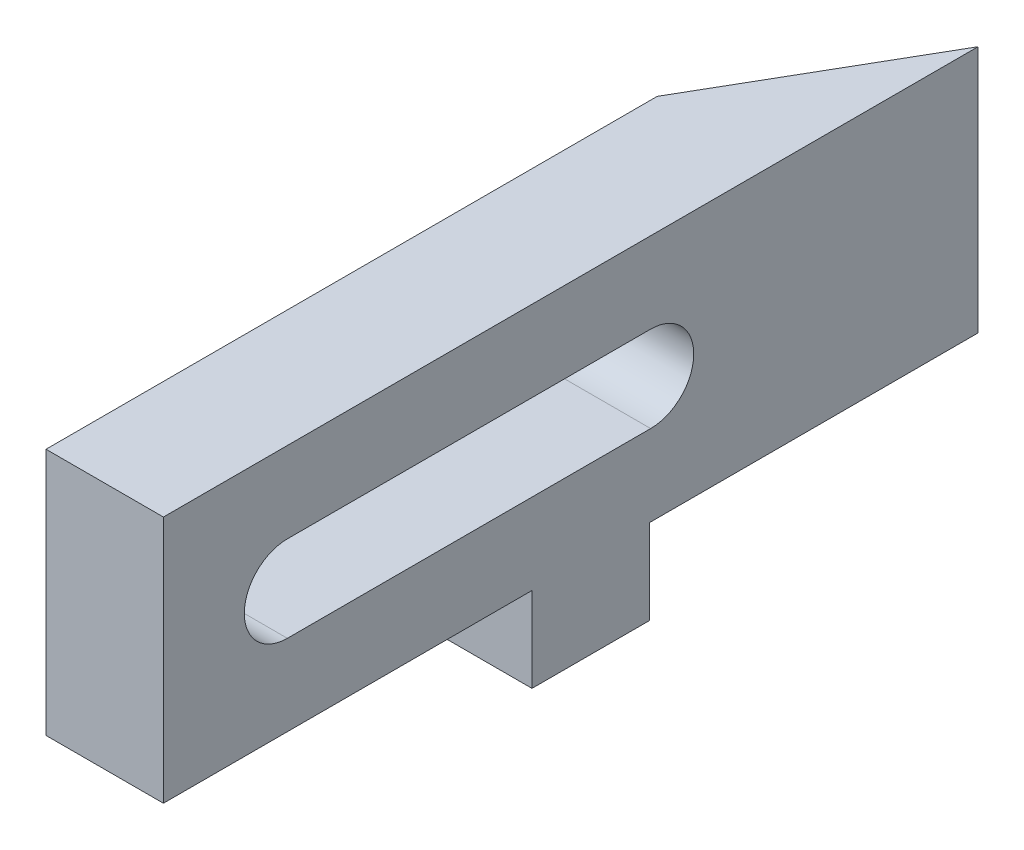
ISO-10303-21;
HEADER;
FILE_DESCRIPTION(('STEP AP214'),'2;1');
FILE_NAME('part.step','',(''),(''),'','','');
FILE_SCHEMA(('AUTOMOTIVE_DESIGN { 1 0 10303 214 1 1 1 1 }'));
ENDSEC;
DATA;
#1=APPLICATION_CONTEXT('core data for automotive mechanical design processes');
#2=APPLICATION_PROTOCOL_DEFINITION('international standard','automotive_design',2000,#1);
#3=PRODUCT_CONTEXT('',#1,'mechanical');
#4=PRODUCT('Part','Part','',(#3));
#5=PRODUCT_RELATED_PRODUCT_CATEGORY('part','',(#4));
#6=PRODUCT_DEFINITION_FORMATION('','',#4);
#7=PRODUCT_DEFINITION_CONTEXT('part definition',#1,'design');
#8=PRODUCT_DEFINITION('design','',#6,#7);
#9=PRODUCT_DEFINITION_SHAPE('','',#8);
#10=(LENGTH_UNIT() NAMED_UNIT(*) SI_UNIT(.MILLI.,.METRE.));
#11=(NAMED_UNIT(*) PLANE_ANGLE_UNIT() SI_UNIT($,.RADIAN.));
#12=(NAMED_UNIT(*) SI_UNIT($,.STERADIAN.) SOLID_ANGLE_UNIT());
#13=UNCERTAINTY_MEASURE_WITH_UNIT(LENGTH_MEASURE(1.E-05),#10,'distance_accuracy_value','');
#14=(GEOMETRIC_REPRESENTATION_CONTEXT(3) GLOBAL_UNCERTAINTY_ASSIGNED_CONTEXT((#13)) GLOBAL_UNIT_ASSIGNED_CONTEXT((#10,
#11,#12)) REPRESENTATION_CONTEXT('',''));
#15=CARTESIAN_POINT('',(0.,0.,0.));
#16=DIRECTION('',(0.,0.,1.));
#17=DIRECTION('',(1.,0.,0.));
#18=AXIS2_PLACEMENT_3D('',#15,#16,#17);
#19=CARTESIAN_POINT('',(0.,0.,0.));
#20=DIRECTION('',(0.,1.,0.));
#21=DIRECTION('',(0.,0.,1.));
#22=AXIS2_PLACEMENT_3D('',#19,#20,#21);
#23=PLANE('',#22);
#24=DIRECTION('',(-1.,0.,0.));
#25=VECTOR('',#24,1.);
#26=CARTESIAN_POINT('',(15.5,0.,-8.25));
#27=LINE('',#26,#25);
#28=CARTESIAN_POINT('',(24.5,0.,-8.25));
#29=VERTEX_POINT('',#28);
#30=CARTESIAN_POINT('',(15.5,0.,-8.25));
#31=VERTEX_POINT('',#30);
#32=EDGE_CURVE('E143',#29,#31,#27,.T.);
#33=ORIENTED_EDGE('',*,*,#32,.F.);
#34=DIRECTION('',(0.,0.,-1.));
#35=VECTOR('',#34,1.);
#36=CARTESIAN_POINT('',(24.5,0.,20.));
#37=LINE('',#36,#35);
#38=CARTESIAN_POINT('',(24.5,0.,20.));
#39=VERTEX_POINT('',#38);
#40=EDGE_CURVE('E201',#39,#29,#37,.T.);
#41=ORIENTED_EDGE('',*,*,#40,.F.);
#42=DIRECTION('',(1.,0.,0.));
#43=VECTOR('',#42,1.);
#44=CARTESIAN_POINT('',(15.5,0.,20.));
#45=LINE('',#44,#43);
#46=CARTESIAN_POINT('',(15.5,0.,20.));
#47=VERTEX_POINT('',#46);
#48=EDGE_CURVE('E212',#47,#39,#45,.T.);
#49=ORIENTED_EDGE('',*,*,#48,.F.);
#50=DIRECTION('',(0.,0.,1.));
#51=VECTOR('',#50,1.);
#52=CARTESIAN_POINT('',(15.5,0.,-26.8467875173176));
#53=LINE('',#52,#51);
#54=EDGE_CURVE('E50',#31,#47,#53,.T.);
#55=ORIENTED_EDGE('',*,*,#54,.F.);
#56=EDGE_LOOP('',(#33,#41,#49,#55));
#57=FACE_BOUND('',#56,.T.);
#58=ADVANCED_FACE('F33',(#57),#23,.F.);
#59=DIRECTION('',(1.,0.,0.));
#60=VECTOR('',#59,1.);
#61=CARTESIAN_POINT('',(24.5,0.,-17.25));
#62=LINE('',#61,#60);
#63=CARTESIAN_POINT('',(15.5,0.,-17.25));
#64=VERTEX_POINT('',#63);
#65=CARTESIAN_POINT('',(24.5,0.,-17.25));
#66=VERTEX_POINT('',#65);
#67=EDGE_CURVE('E58',#64,#66,#62,.T.);
#68=ORIENTED_EDGE('',*,*,#67,.F.);
#69=CARTESIAN_POINT('',(15.5,0.,-26.8467875173176));
#70=VERTEX_POINT('',#69);
#71=EDGE_CURVE('E146',#70,#64,#53,.T.);
#72=ORIENTED_EDGE('',*,*,#71,.F.);
#73=DIRECTION('',(-0.5,0.,0.866025403784439));
#74=VECTOR('',#73,1.);
#75=CARTESIAN_POINT('',(24.5,0.,-42.4352447854375));
#76=LINE('',#75,#74);
#77=CARTESIAN_POINT('',(24.5,0.,-42.4352447854375));
#78=VERTEX_POINT('',#77);
#79=EDGE_CURVE('E190',#78,#70,#76,.T.);
#80=ORIENTED_EDGE('',*,*,#79,.F.);
#81=EDGE_CURVE('E219',#66,#78,#37,.T.);
#82=ORIENTED_EDGE('',*,*,#81,.F.);
#83=EDGE_LOOP('',(#68,#72,#80,#82));
#84=FACE_BOUND('',#83,.T.);
#85=ADVANCED_FACE('F251',(#84),#23,.F.);
#86=CARTESIAN_POINT('',(24.5,19.,-42.4352447854375));
#87=DIRECTION('',(0.866025403784439,0.,0.5));
#88=DIRECTION('',(0.5,0.,-0.866025403784439));
#89=AXIS2_PLACEMENT_3D('',#86,#87,#88);
#90=PLANE('',#89);
#91=ORIENTED_EDGE('',*,*,#79,.T.);
#92=DIRECTION('',(0.,-1.,0.));
#93=VECTOR('',#92,1.);
#94=CARTESIAN_POINT('',(15.5,19.,-26.8467875173176));
#95=LINE('',#94,#93);
#96=CARTESIAN_POINT('',(15.5,19.,-26.8467875173176));
#97=VERTEX_POINT('',#96);
#98=EDGE_CURVE('E11',#97,#70,#95,.T.);
#99=ORIENTED_EDGE('',*,*,#98,.F.);
#100=DIRECTION('',(-0.5,0.,0.866025403784439));
#101=VECTOR('',#100,1.);
#102=CARTESIAN_POINT('',(24.5,19.,-42.4352447854375));
#103=LINE('',#102,#101);
#104=CARTESIAN_POINT('',(24.5,19.,-42.4352447854375));
#105=VERTEX_POINT('',#104);
#106=EDGE_CURVE('E197',#105,#97,#103,.T.);
#107=ORIENTED_EDGE('',*,*,#106,.F.);
#108=DIRECTION('',(0.,-1.,0.));
#109=VECTOR('',#108,1.);
#110=CARTESIAN_POINT('',(24.5,19.,-42.4352447854375));
#111=LINE('',#110,#109);
#112=EDGE_CURVE('E207',#105,#78,#111,.T.);
#113=ORIENTED_EDGE('',*,*,#112,.T.);
#114=EDGE_LOOP('',(#91,#99,#107,#113));
#115=FACE_BOUND('',#114,.T.);
#116=ADVANCED_FACE('F35',(#115),#90,.F.);
#117=CARTESIAN_POINT('',(15.5,19.,-26.8467875173176));
#118=DIRECTION('',(1.,0.,0.));
#119=DIRECTION('',(0.,0.,-1.));
#120=AXIS2_PLACEMENT_3D('',#117,#118,#119);
#121=PLANE('',#120);
#122=DIRECTION('',(0.,0.,1.));
#123=VECTOR('',#122,1.);
#124=CARTESIAN_POINT('',(15.5,6.2,-17.3467875173176));
#125=LINE('',#124,#123);
#126=CARTESIAN_POINT('',(15.5,6.2,-17.3467875173176));
#127=VERTEX_POINT('',#126);
#128=CARTESIAN_POINT('',(15.5,6.2,10.5));
#129=VERTEX_POINT('',#128);
#130=EDGE_CURVE('E149',#127,#129,#125,.T.);
#131=ORIENTED_EDGE('',*,*,#130,.F.);
#132=CARTESIAN_POINT('',(15.5,9.5,-17.3467875173176));
#133=DIRECTION('',(-1.,0.,0.));
#134=DIRECTION('',(0.,0.,1.));
#135=AXIS2_PLACEMENT_3D('',#132,#133,#134);
#136=CIRCLE('',#135,3.3);
#137=CARTESIAN_POINT('',(15.5,12.8,-17.3467875173176));
#138=VERTEX_POINT('',#137);
#139=EDGE_CURVE('E147',#138,#127,#136,.T.);
#140=ORIENTED_EDGE('',*,*,#139,.F.);
#141=DIRECTION('',(0.,0.,-1.));
#142=VECTOR('',#141,1.);
#143=CARTESIAN_POINT('',(15.5,12.8,-17.3467875173176));
#144=LINE('',#143,#142);
#145=CARTESIAN_POINT('',(15.5,12.8,10.5));
#146=VERTEX_POINT('',#145);
#147=EDGE_CURVE('E171',#146,#138,#144,.T.);
#148=ORIENTED_EDGE('',*,*,#147,.F.);
#149=CARTESIAN_POINT('',(15.5,9.5,10.5));
#150=DIRECTION('',(-1.,0.,0.));
#151=DIRECTION('',(0.,0.,1.));
#152=AXIS2_PLACEMENT_3D('',#149,#150,#151);
#153=CIRCLE('',#152,3.3);
#154=EDGE_CURVE('E183',#129,#146,#153,.T.);
#155=ORIENTED_EDGE('',*,*,#154,.F.);
#156=EDGE_LOOP('',(#131,#140,#148,#155));
#157=FACE_BOUND('',#156,.T.);
#158=ORIENTED_EDGE('',*,*,#71,.T.);
#159=DIRECTION('',(0.,1.,0.));
#160=VECTOR('',#159,1.);
#161=CARTESIAN_POINT('',(15.5,-6.5,-17.25));
#162=LINE('',#161,#160);
#163=CARTESIAN_POINT('',(15.5,-6.5,-17.25));
#164=VERTEX_POINT('',#163);
#165=EDGE_CURVE('E128',#164,#64,#162,.T.);
#166=ORIENTED_EDGE('',*,*,#165,.F.);
#167=DIRECTION('',(0.,0.,-1.));
#168=VECTOR('',#167,1.);
#169=CARTESIAN_POINT('',(15.5,-6.5,-17.25));
#170=LINE('',#169,#168);
#171=CARTESIAN_POINT('',(15.5,-6.5,-8.25));
#172=VERTEX_POINT('',#171);
#173=EDGE_CURVE('E134',#172,#164,#170,.T.);
#174=ORIENTED_EDGE('',*,*,#173,.F.);
#175=DIRECTION('',(0.,1.,0.));
#176=VECTOR('',#175,1.);
#177=CARTESIAN_POINT('',(15.5,-6.5,-8.25));
#178=LINE('',#177,#176);
#179=EDGE_CURVE('E160',#172,#31,#178,.T.);
#180=ORIENTED_EDGE('',*,*,#179,.T.);
#181=ORIENTED_EDGE('',*,*,#54,.T.);
#182=DIRECTION('',(0.,-1.,0.));
#183=VECTOR('',#182,1.);
#184=CARTESIAN_POINT('',(15.5,19.,20.));
#185=LINE('',#184,#183);
#186=CARTESIAN_POINT('',(15.5,19.,20.));
#187=VERTEX_POINT('',#186);
#188=EDGE_CURVE('E42',#187,#47,#185,.T.);
#189=ORIENTED_EDGE('',*,*,#188,.F.);
#190=DIRECTION('',(0.,0.,1.));
#191=VECTOR('',#190,1.);
#192=CARTESIAN_POINT('',(15.5,19.,-26.8467875173176));
#193=LINE('',#192,#191);
#194=EDGE_CURVE('E200',#97,#187,#193,.T.);
#195=ORIENTED_EDGE('',*,*,#194,.F.);
#196=ORIENTED_EDGE('',*,*,#98,.T.);
#197=EDGE_LOOP('',(#158,#166,#174,#180,#181,#189,#195,#196));
#198=FACE_BOUND('',#197,.T.);
#199=ADVANCED_FACE('F145',(#157,#198),#121,.F.);
#200=CARTESIAN_POINT('',(15.5,19.,20.));
#201=DIRECTION('',(0.,0.,-1.));
#202=DIRECTION('',(-1.,0.,0.));
#203=AXIS2_PLACEMENT_3D('',#200,#201,#202);
#204=PLANE('',#203);
#205=ORIENTED_EDGE('',*,*,#48,.T.);
#206=DIRECTION('',(0.,-1.,0.));
#207=VECTOR('',#206,1.);
#208=CARTESIAN_POINT('',(24.5,19.,20.));
#209=LINE('',#208,#207);
#210=CARTESIAN_POINT('',(24.5,19.,20.));
#211=VERTEX_POINT('',#210);
#212=EDGE_CURVE('E226',#211,#39,#209,.T.);
#213=ORIENTED_EDGE('',*,*,#212,.F.);
#214=DIRECTION('',(1.,0.,0.));
#215=VECTOR('',#214,1.);
#216=CARTESIAN_POINT('',(15.5,19.,20.));
#217=LINE('',#216,#215);
#218=EDGE_CURVE('E203',#187,#211,#217,.T.);
#219=ORIENTED_EDGE('',*,*,#218,.F.);
#220=ORIENTED_EDGE('',*,*,#188,.T.);
#221=EDGE_LOOP('',(#205,#213,#219,#220));
#222=FACE_BOUND('',#221,.T.);
#223=ADVANCED_FACE('F233',(#222),#204,.F.);
#224=CARTESIAN_POINT('',(24.5,19.,20.));
#225=DIRECTION('',(-1.,0.,0.));
#226=DIRECTION('',(0.,0.,1.));
#227=AXIS2_PLACEMENT_3D('',#224,#225,#226);
#228=PLANE('',#227);
#229=DIRECTION('',(0.,0.,-1.));
#230=VECTOR('',#229,1.);
#231=CARTESIAN_POINT('',(24.5,12.8,-17.3467875173176));
#232=LINE('',#231,#230);
#233=CARTESIAN_POINT('',(24.5,12.8,10.5));
#234=VERTEX_POINT('',#233);
#235=CARTESIAN_POINT('',(24.5,12.8,-17.3467875173176));
#236=VERTEX_POINT('',#235);
#237=EDGE_CURVE('E177',#234,#236,#232,.T.);
#238=ORIENTED_EDGE('',*,*,#237,.T.);
#239=CARTESIAN_POINT('',(24.5,9.5,-17.3467875173176));
#240=DIRECTION('',(-1.,0.,0.));
#241=DIRECTION('',(0.,0.,1.));
#242=AXIS2_PLACEMENT_3D('',#239,#240,#241);
#243=CIRCLE('',#242,3.3);
#244=CARTESIAN_POINT('',(24.5,6.2,-17.3467875173176));
#245=VERTEX_POINT('',#244);
#246=EDGE_CURVE('E167',#236,#245,#243,.T.);
#247=ORIENTED_EDGE('',*,*,#246,.T.);
#248=DIRECTION('',(0.,0.,1.));
#249=VECTOR('',#248,1.);
#250=CARTESIAN_POINT('',(24.5,6.2,-17.3467875173176));
#251=LINE('',#250,#249);
#252=CARTESIAN_POINT('',(24.5,6.2,10.5));
#253=VERTEX_POINT('',#252);
#254=EDGE_CURVE('E170',#245,#253,#251,.T.);
#255=ORIENTED_EDGE('',*,*,#254,.T.);
#256=CARTESIAN_POINT('',(24.5,9.5,10.5));
#257=DIRECTION('',(-1.,0.,0.));
#258=DIRECTION('',(0.,0.,1.));
#259=AXIS2_PLACEMENT_3D('',#256,#257,#258);
#260=CIRCLE('',#259,3.3);
#261=EDGE_CURVE('E174',#253,#234,#260,.T.);
#262=ORIENTED_EDGE('',*,*,#261,.T.);
#263=EDGE_LOOP('',(#238,#247,#255,#262));
#264=FACE_BOUND('',#263,.T.);
#265=ORIENTED_EDGE('',*,*,#40,.T.);
#266=DIRECTION('',(0.,1.,0.));
#267=VECTOR('',#266,1.);
#268=CARTESIAN_POINT('',(24.5,-6.5,-8.25));
#269=LINE('',#268,#267);
#270=CARTESIAN_POINT('',(24.5,-6.5,-8.25));
#271=VERTEX_POINT('',#270);
#272=EDGE_CURVE('E151',#271,#29,#269,.T.);
#273=ORIENTED_EDGE('',*,*,#272,.F.);
#274=DIRECTION('',(0.,0.,1.));
#275=VECTOR('',#274,1.);
#276=CARTESIAN_POINT('',(24.5,-6.5,-8.25));
#277=LINE('',#276,#275);
#278=CARTESIAN_POINT('',(24.5,-6.5,-17.25));
#279=VERTEX_POINT('',#278);
#280=EDGE_CURVE('E133',#279,#271,#277,.T.);
#281=ORIENTED_EDGE('',*,*,#280,.F.);
#282=DIRECTION('',(0.,1.,0.));
#283=VECTOR('',#282,1.);
#284=CARTESIAN_POINT('',(24.5,-6.5,-17.25));
#285=LINE('',#284,#283);
#286=EDGE_CURVE('E130',#279,#66,#285,.T.);
#287=ORIENTED_EDGE('',*,*,#286,.T.);
#288=ORIENTED_EDGE('',*,*,#81,.T.);
#289=ORIENTED_EDGE('',*,*,#112,.F.);
#290=DIRECTION('',(0.,0.,-1.));
#291=VECTOR('',#290,1.);
#292=CARTESIAN_POINT('',(24.5,19.,20.));
#293=LINE('',#292,#291);
#294=EDGE_CURVE('E205',#211,#105,#293,.T.);
#295=ORIENTED_EDGE('',*,*,#294,.F.);
#296=ORIENTED_EDGE('',*,*,#212,.T.);
#297=EDGE_LOOP('',(#265,#273,#281,#287,#288,#289,#295,#296));
#298=FACE_BOUND('',#297,.T.);
#299=ADVANCED_FACE('F240',(#264,#298),#228,.F.);
#300=CARTESIAN_POINT('',(0.,19.,0.));
#301=DIRECTION('',(0.,1.,0.));
#302=DIRECTION('',(0.,0.,1.));
#303=AXIS2_PLACEMENT_3D('',#300,#301,#302);
#304=PLANE('',#303);
#305=ORIENTED_EDGE('',*,*,#106,.T.);
#306=ORIENTED_EDGE('',*,*,#194,.T.);
#307=ORIENTED_EDGE('',*,*,#218,.T.);
#308=ORIENTED_EDGE('',*,*,#294,.T.);
#309=EDGE_LOOP('',(#305,#306,#307,#308));
#310=FACE_BOUND('',#309,.T.);
#311=ADVANCED_FACE('F253',(#310),#304,.T.);
#312=CARTESIAN_POINT('',(24.5,9.5,-17.3467875173176));
#313=DIRECTION('',(-1.,0.,0.));
#314=DIRECTION('',(0.,0.,1.));
#315=AXIS2_PLACEMENT_3D('',#312,#313,#314);
#316=CYLINDRICAL_SURFACE('',#315,3.3);
#317=ORIENTED_EDGE('',*,*,#139,.T.);
#318=DIRECTION('',(-1.,0.,0.));
#319=VECTOR('',#318,1.);
#320=CARTESIAN_POINT('',(24.5,6.2,-17.3467875173176));
#321=LINE('',#320,#319);
#322=EDGE_CURVE('E179',#245,#127,#321,.T.);
#323=ORIENTED_EDGE('',*,*,#322,.F.);
#324=ORIENTED_EDGE('',*,*,#246,.F.);
#325=DIRECTION('',(-1.,0.,0.));
#326=VECTOR('',#325,1.);
#327=CARTESIAN_POINT('',(24.5,12.8,-17.3467875173176));
#328=LINE('',#327,#326);
#329=EDGE_CURVE('E188',#236,#138,#328,.T.);
#330=ORIENTED_EDGE('',*,*,#329,.T.);
#331=EDGE_LOOP('',(#317,#323,#324,#330));
#332=FACE_BOUND('',#331,.T.);
#333=ADVANCED_FACE('F255',(#332),#316,.F.);
#334=CARTESIAN_POINT('',(24.5,12.8,-17.3467875173176));
#335=DIRECTION('',(0.,1.,0.));
#336=DIRECTION('',(0.,0.,1.));
#337=AXIS2_PLACEMENT_3D('',#334,#335,#336);
#338=PLANE('',#337);
#339=ORIENTED_EDGE('',*,*,#147,.T.);
#340=ORIENTED_EDGE('',*,*,#329,.F.);
#341=ORIENTED_EDGE('',*,*,#237,.F.);
#342=DIRECTION('',(-1.,0.,0.));
#343=VECTOR('',#342,1.);
#344=CARTESIAN_POINT('',(24.5,12.8,10.5));
#345=LINE('',#344,#343);
#346=EDGE_CURVE('E191',#234,#146,#345,.T.);
#347=ORIENTED_EDGE('',*,*,#346,.T.);
#348=EDGE_LOOP('',(#339,#340,#341,#347));
#349=FACE_BOUND('',#348,.T.);
#350=ADVANCED_FACE('F261',(#349),#338,.F.);
#351=CARTESIAN_POINT('',(24.5,9.5,10.5));
#352=DIRECTION('',(-1.,0.,0.));
#353=DIRECTION('',(0.,0.,1.));
#354=AXIS2_PLACEMENT_3D('',#351,#352,#353);
#355=CYLINDRICAL_SURFACE('',#354,3.3);
#356=ORIENTED_EDGE('',*,*,#154,.T.);
#357=ORIENTED_EDGE('',*,*,#346,.F.);
#358=ORIENTED_EDGE('',*,*,#261,.F.);
#359=DIRECTION('',(-1.,0.,0.));
#360=VECTOR('',#359,1.);
#361=CARTESIAN_POINT('',(24.5,6.2,10.5));
#362=LINE('',#361,#360);
#363=EDGE_CURVE('E193',#253,#129,#362,.T.);
#364=ORIENTED_EDGE('',*,*,#363,.T.);
#365=EDGE_LOOP('',(#356,#357,#358,#364));
#366=FACE_BOUND('',#365,.T.);
#367=ADVANCED_FACE('F292',(#366),#355,.F.);
#368=CARTESIAN_POINT('',(24.5,6.2,-17.3467875173176));
#369=DIRECTION('',(0.,-1.,0.));
#370=DIRECTION('',(0.,0.,-1.));
#371=AXIS2_PLACEMENT_3D('',#368,#369,#370);
#372=PLANE('',#371);
#373=ORIENTED_EDGE('',*,*,#130,.T.);
#374=ORIENTED_EDGE('',*,*,#363,.F.);
#375=ORIENTED_EDGE('',*,*,#254,.F.);
#376=ORIENTED_EDGE('',*,*,#322,.T.);
#377=EDGE_LOOP('',(#373,#374,#375,#376));
#378=FACE_BOUND('',#377,.T.);
#379=ADVANCED_FACE('F286',(#378),#372,.F.);
#380=CARTESIAN_POINT('',(24.5,-6.5,-17.25));
#381=DIRECTION('',(0.,0.,1.));
#382=DIRECTION('',(1.,0.,0.));
#383=AXIS2_PLACEMENT_3D('',#380,#381,#382);
#384=PLANE('',#383);
#385=ORIENTED_EDGE('',*,*,#67,.T.);
#386=ORIENTED_EDGE('',*,*,#286,.F.);
#387=DIRECTION('',(1.,0.,0.));
#388=VECTOR('',#387,1.);
#389=CARTESIAN_POINT('',(24.5,-6.5,-17.25));
#390=LINE('',#389,#388);
#391=EDGE_CURVE('E124',#164,#279,#390,.T.);
#392=ORIENTED_EDGE('',*,*,#391,.F.);
#393=ORIENTED_EDGE('',*,*,#165,.T.);
#394=EDGE_LOOP('',(#385,#386,#392,#393));
#395=FACE_BOUND('',#394,.T.);
#396=ADVANCED_FACE('F126',(#395),#384,.F.);
#397=CARTESIAN_POINT('',(15.5,-6.5,-8.25));
#398=DIRECTION('',(0.,0.,-1.));
#399=DIRECTION('',(-1.,0.,0.));
#400=AXIS2_PLACEMENT_3D('',#397,#398,#399);
#401=PLANE('',#400);
#402=ORIENTED_EDGE('',*,*,#32,.T.);
#403=ORIENTED_EDGE('',*,*,#179,.F.);
#404=DIRECTION('',(-1.,0.,0.));
#405=VECTOR('',#404,1.);
#406=CARTESIAN_POINT('',(15.5,-6.5,-8.25));
#407=LINE('',#406,#405);
#408=EDGE_CURVE('E139',#271,#172,#407,.T.);
#409=ORIENTED_EDGE('',*,*,#408,.F.);
#410=ORIENTED_EDGE('',*,*,#272,.T.);
#411=EDGE_LOOP('',(#402,#403,#409,#410));
#412=FACE_BOUND('',#411,.T.);
#413=ADVANCED_FACE('F243',(#412),#401,.F.);
#414=CARTESIAN_POINT('',(0.,-6.5,0.));
#415=DIRECTION('',(0.,1.,0.));
#416=DIRECTION('',(0.,0.,1.));
#417=AXIS2_PLACEMENT_3D('',#414,#415,#416);
#418=PLANE('',#417);
#419=ORIENTED_EDGE('',*,*,#173,.T.);
#420=ORIENTED_EDGE('',*,*,#391,.T.);
#421=ORIENTED_EDGE('',*,*,#280,.T.);
#422=ORIENTED_EDGE('',*,*,#408,.T.);
#423=EDGE_LOOP('',(#419,#420,#421,#422));
#424=FACE_BOUND('',#423,.T.);
#425=ADVANCED_FACE('F137',(#424),#418,.F.);
#426=CLOSED_SHELL('',(#58,#85,#116,#199,#223,#299,#311,#333,#350,#367,#379,#396,#413,#425));
#427=MANIFOLD_SOLID_BREP('B2',#426);
#428=ADVANCED_BREP_SHAPE_REPRESENTATION('',(#18,#427),#14);
#429=SHAPE_DEFINITION_REPRESENTATION(#9,#428);
ENDSEC;
END-ISO-10303-21;
